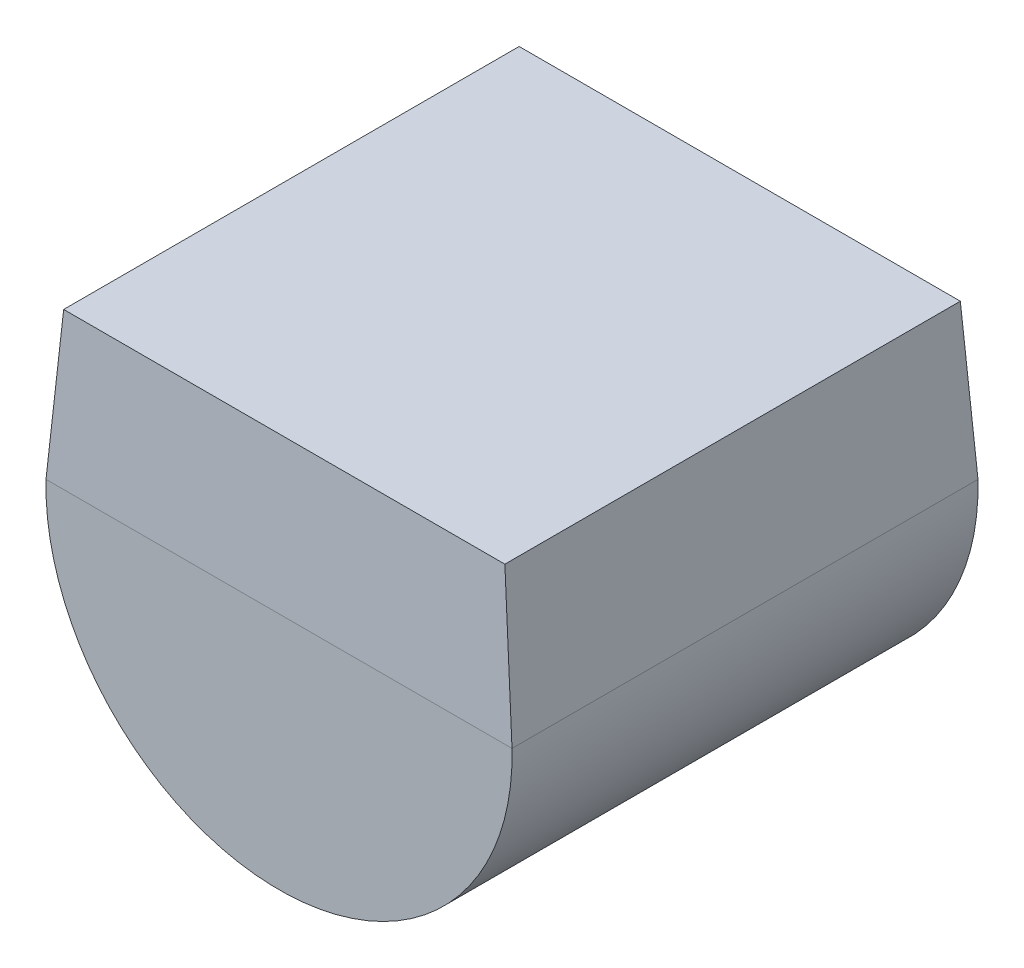
ISO-10303-21;
HEADER;
FILE_DESCRIPTION(('STEP AP214'),'2;1');
FILE_NAME('part.step','',(''),(''),'','','');
FILE_SCHEMA(('AUTOMOTIVE_DESIGN { 1 0 10303 214 1 1 1 1 }'));
ENDSEC;
DATA;
#1=APPLICATION_CONTEXT('core data for automotive mechanical design processes');
#2=APPLICATION_PROTOCOL_DEFINITION('international standard','automotive_design',2000,#1);
#3=PRODUCT_CONTEXT('',#1,'mechanical');
#4=PRODUCT('Part','Part','',(#3));
#5=PRODUCT_RELATED_PRODUCT_CATEGORY('part','',(#4));
#6=PRODUCT_DEFINITION_FORMATION('','',#4);
#7=PRODUCT_DEFINITION_CONTEXT('part definition',#1,'design');
#8=PRODUCT_DEFINITION('design','',#6,#7);
#9=PRODUCT_DEFINITION_SHAPE('','',#8);
#10=(LENGTH_UNIT() NAMED_UNIT(*) SI_UNIT(.MILLI.,.METRE.));
#11=(NAMED_UNIT(*) PLANE_ANGLE_UNIT() SI_UNIT($,.RADIAN.));
#12=(NAMED_UNIT(*) SI_UNIT($,.STERADIAN.) SOLID_ANGLE_UNIT());
#13=UNCERTAINTY_MEASURE_WITH_UNIT(LENGTH_MEASURE(1.E-05),#10,'distance_accuracy_value','');
#14=(GEOMETRIC_REPRESENTATION_CONTEXT(3) GLOBAL_UNCERTAINTY_ASSIGNED_CONTEXT((#13)) GLOBAL_UNIT_ASSIGNED_CONTEXT((#10,
#11,#12)) REPRESENTATION_CONTEXT('',''));
#15=CARTESIAN_POINT('',(0.,0.,0.));
#16=DIRECTION('',(0.,0.,1.));
#17=DIRECTION('',(1.,0.,0.));
#18=AXIS2_PLACEMENT_3D('',#15,#16,#17);
#19=CARTESIAN_POINT('',(0.,0.,1.));
#20=DIRECTION('',(0.,0.,1.));
#21=DIRECTION('',(1.,0.,0.));
#22=AXIS2_PLACEMENT_3D('',#19,#20,#21);
#23=PLANE('',#22);
#24=DIRECTION('',(1.,0.,0.));
#25=VECTOR('',#24,1.);
#26=CARTESIAN_POINT('',(3.875,0.,1.));
#27=LINE('',#26,#25);
#28=CARTESIAN_POINT('',(3.875,0.,1.));
#29=VERTEX_POINT('',#28);
#30=CARTESIAN_POINT('',(3.365,0.,1.));
#31=VERTEX_POINT('',#30);
#32=EDGE_CURVE('E357',#29,#31,#27,.F.);
#33=ORIENTED_EDGE('',*,*,#32,.F.);
#34=DIRECTION('',(0.,1.,0.));
#35=VECTOR('',#34,1.);
#36=CARTESIAN_POINT('',(3.875,-0.48,1.));
#37=LINE('',#36,#35);
#38=CARTESIAN_POINT('',(3.875,-0.48,1.));
#39=VERTEX_POINT('',#38);
#40=EDGE_CURVE('E246',#39,#29,#37,.T.);
#41=ORIENTED_EDGE('',*,*,#40,.F.);
#42=DIRECTION('',(1.,0.,0.));
#43=VECTOR('',#42,1.);
#44=CARTESIAN_POINT('',(3.365,-0.48,1.));
#45=LINE('',#44,#43);
#46=CARTESIAN_POINT('',(3.365,-0.48,1.));
#47=VERTEX_POINT('',#46);
#48=EDGE_CURVE('E245',#47,#39,#45,.T.);
#49=ORIENTED_EDGE('',*,*,#48,.F.);
#50=DIRECTION('',(0.,1.,0.));
#51=VECTOR('',#50,1.);
#52=CARTESIAN_POINT('',(3.365,0.,1.));
#53=LINE('',#52,#51);
#54=EDGE_CURVE('E340',#31,#47,#53,.F.);
#55=ORIENTED_EDGE('',*,*,#54,.F.);
#56=EDGE_LOOP('',(#33,#41,#49,#55));
#57=FACE_BOUND('',#56,.T.);
#58=ADVANCED_FACE('F16',(#57),#23,.F.);
#59=CARTESIAN_POINT('',(3.875,0.,1.));
#60=DIRECTION('',(0.,-1.,0.));
#61=DIRECTION('',(0.,0.,-1.));
#62=AXIS2_PLACEMENT_3D('',#59,#60,#61);
#63=PLANE('',#62);
#64=DIRECTION('',(1.,0.,0.));
#65=VECTOR('',#64,1.);
#66=CARTESIAN_POINT('',(4.575,0.,0.));
#67=LINE('',#66,#65);
#68=CARTESIAN_POINT('',(3.365,0.,0.));
#69=VERTEX_POINT('',#68);
#70=CARTESIAN_POINT('',(3.875,0.,0.));
#71=VERTEX_POINT('',#70);
#72=EDGE_CURVE('E233',#69,#71,#67,.T.);
#73=ORIENTED_EDGE('',*,*,#72,.T.);
#74=DIRECTION('',(0.,0.,1.));
#75=VECTOR('',#74,1.);
#76=CARTESIAN_POINT('',(3.875,0.,1.));
#77=LINE('',#76,#75);
#78=EDGE_CURVE('E242',#29,#71,#77,.F.);
#79=ORIENTED_EDGE('',*,*,#78,.F.);
#80=ORIENTED_EDGE('',*,*,#32,.T.);
#81=DIRECTION('',(0.,0.,-1.));
#82=VECTOR('',#81,1.);
#83=CARTESIAN_POINT('',(3.365,0.,1.));
#84=LINE('',#83,#82);
#85=EDGE_CURVE('E259',#69,#31,#84,.F.);
#86=ORIENTED_EDGE('',*,*,#85,.F.);
#87=EDGE_LOOP('',(#73,#79,#80,#86));
#88=FACE_BOUND('',#87,.T.);
#89=ADVANCED_FACE('F426',(#88),#63,.T.);
#90=CARTESIAN_POINT('',(0.,0.,1.));
#91=DIRECTION('',(0.,0.,1.));
#92=DIRECTION('',(1.,0.,0.));
#93=AXIS2_PLACEMENT_3D('',#90,#91,#92);
#94=PLANE('',#93);
#95=DIRECTION('',(0.,1.,0.));
#96=VECTOR('',#95,1.);
#97=CARTESIAN_POINT('',(2.095,0.,1.));
#98=LINE('',#97,#96);
#99=CARTESIAN_POINT('',(2.095,0.,1.));
#100=VERTEX_POINT('',#99);
#101=CARTESIAN_POINT('',(2.095,-0.48,1.));
#102=VERTEX_POINT('',#101);
#103=EDGE_CURVE('E380',#100,#102,#98,.F.);
#104=ORIENTED_EDGE('',*,*,#103,.F.);
#105=DIRECTION('',(1.,0.,0.));
#106=VECTOR('',#105,1.);
#107=CARTESIAN_POINT('',(2.605,0.,1.));
#108=LINE('',#107,#106);
#109=CARTESIAN_POINT('',(2.605,0.,1.));
#110=VERTEX_POINT('',#109);
#111=EDGE_CURVE('E224',#110,#100,#108,.F.);
#112=ORIENTED_EDGE('',*,*,#111,.F.);
#113=DIRECTION('',(0.,1.,0.));
#114=VECTOR('',#113,1.);
#115=CARTESIAN_POINT('',(2.605,-0.48,1.));
#116=LINE('',#115,#114);
#117=CARTESIAN_POINT('',(2.605,-0.48,1.));
#118=VERTEX_POINT('',#117);
#119=EDGE_CURVE('E262',#118,#110,#116,.T.);
#120=ORIENTED_EDGE('',*,*,#119,.F.);
#121=DIRECTION('',(1.,0.,0.));
#122=VECTOR('',#121,1.);
#123=CARTESIAN_POINT('',(2.095,-0.48,1.));
#124=LINE('',#123,#122);
#125=EDGE_CURVE('E277',#102,#118,#124,.T.);
#126=ORIENTED_EDGE('',*,*,#125,.F.);
#127=EDGE_LOOP('',(#104,#112,#120,#126));
#128=FACE_BOUND('',#127,.T.);
#129=ADVANCED_FACE('F385',(#128),#94,.F.);
#130=CARTESIAN_POINT('',(2.605,0.,1.));
#131=DIRECTION('',(0.,-1.,0.));
#132=DIRECTION('',(0.,0.,-1.));
#133=AXIS2_PLACEMENT_3D('',#130,#131,#132);
#134=PLANE('',#133);
#135=DIRECTION('',(1.,0.,0.));
#136=VECTOR('',#135,1.);
#137=CARTESIAN_POINT('',(4.575,0.,0.));
#138=LINE('',#137,#136);
#139=CARTESIAN_POINT('',(2.095,0.,0.));
#140=VERTEX_POINT('',#139);
#141=CARTESIAN_POINT('',(2.605,0.,0.));
#142=VERTEX_POINT('',#141);
#143=EDGE_CURVE('E267',#140,#142,#138,.T.);
#144=ORIENTED_EDGE('',*,*,#143,.T.);
#145=DIRECTION('',(0.,0.,1.));
#146=VECTOR('',#145,1.);
#147=CARTESIAN_POINT('',(2.605,0.,1.));
#148=LINE('',#147,#146);
#149=EDGE_CURVE('E274',#110,#142,#148,.F.);
#150=ORIENTED_EDGE('',*,*,#149,.F.);
#151=ORIENTED_EDGE('',*,*,#111,.T.);
#152=DIRECTION('',(0.,0.,-1.));
#153=VECTOR('',#152,1.);
#154=CARTESIAN_POINT('',(2.095,0.,1.));
#155=LINE('',#154,#153);
#156=EDGE_CURVE('E289',#140,#100,#155,.F.);
#157=ORIENTED_EDGE('',*,*,#156,.F.);
#158=EDGE_LOOP('',(#144,#150,#151,#157));
#159=FACE_BOUND('',#158,.T.);
#160=ADVANCED_FACE('F322',(#159),#134,.T.);
#161=CARTESIAN_POINT('',(0.,0.,1.));
#162=DIRECTION('',(0.,0.,1.));
#163=DIRECTION('',(1.,0.,0.));
#164=AXIS2_PLACEMENT_3D('',#161,#162,#163);
#165=PLANE('',#164);
#166=DIRECTION('',(1.,0.,0.));
#167=VECTOR('',#166,1.);
#168=CARTESIAN_POINT('',(1.335,0.,1.));
#169=LINE('',#168,#167);
#170=CARTESIAN_POINT('',(1.335,0.,1.));
#171=VERTEX_POINT('',#170);
#172=CARTESIAN_POINT('',(0.824999999999998,0.,1.));
#173=VERTEX_POINT('',#172);
#174=EDGE_CURVE('E221',#171,#173,#169,.F.);
#175=ORIENTED_EDGE('',*,*,#174,.F.);
#176=DIRECTION('',(0.,1.,0.));
#177=VECTOR('',#176,1.);
#178=CARTESIAN_POINT('',(1.335,-0.48,1.));
#179=LINE('',#178,#177);
#180=CARTESIAN_POINT('',(1.335,-0.48,1.));
#181=VERTEX_POINT('',#180);
#182=EDGE_CURVE('E292',#181,#171,#179,.T.);
#183=ORIENTED_EDGE('',*,*,#182,.F.);
#184=DIRECTION('',(1.,0.,0.));
#185=VECTOR('',#184,1.);
#186=CARTESIAN_POINT('',(0.824999999999998,-0.48,1.));
#187=LINE('',#186,#185);
#188=CARTESIAN_POINT('',(0.824999999999998,-0.48,1.));
#189=VERTEX_POINT('',#188);
#190=EDGE_CURVE('E305',#189,#181,#187,.T.);
#191=ORIENTED_EDGE('',*,*,#190,.F.);
#192=DIRECTION('',(0.,1.,0.));
#193=VECTOR('',#192,1.);
#194=CARTESIAN_POINT('',(0.824999999999998,0.,1.));
#195=LINE('',#194,#193);
#196=EDGE_CURVE('E151',#173,#189,#195,.F.);
#197=ORIENTED_EDGE('',*,*,#196,.F.);
#198=EDGE_LOOP('',(#175,#183,#191,#197));
#199=FACE_BOUND('',#198,.T.);
#200=ADVANCED_FACE('F419',(#199),#165,.F.);
#201=CARTESIAN_POINT('',(1.335,0.,1.));
#202=DIRECTION('',(0.,-1.,0.));
#203=DIRECTION('',(0.,0.,-1.));
#204=AXIS2_PLACEMENT_3D('',#201,#202,#203);
#205=PLANE('',#204);
#206=DIRECTION('',(1.,0.,0.));
#207=VECTOR('',#206,1.);
#208=CARTESIAN_POINT('',(4.575,0.,0.));
#209=LINE('',#208,#207);
#210=CARTESIAN_POINT('',(0.824999999999998,0.,0.));
#211=VERTEX_POINT('',#210);
#212=CARTESIAN_POINT('',(1.335,0.,0.));
#213=VERTEX_POINT('',#212);
#214=EDGE_CURVE('E173',#211,#213,#209,.T.);
#215=ORIENTED_EDGE('',*,*,#214,.T.);
#216=DIRECTION('',(0.,0.,1.));
#217=VECTOR('',#216,1.);
#218=CARTESIAN_POINT('',(1.335,0.,1.));
#219=LINE('',#218,#217);
#220=EDGE_CURVE('E302',#171,#213,#219,.F.);
#221=ORIENTED_EDGE('',*,*,#220,.F.);
#222=ORIENTED_EDGE('',*,*,#174,.T.);
#223=DIRECTION('',(0.,0.,-1.));
#224=VECTOR('',#223,1.);
#225=CARTESIAN_POINT('',(0.824999999999998,0.,1.));
#226=LINE('',#225,#224);
#227=EDGE_CURVE('E152',#211,#173,#226,.F.);
#228=ORIENTED_EDGE('',*,*,#227,.F.);
#229=EDGE_LOOP('',(#215,#221,#222,#228));
#230=FACE_BOUND('',#229,.T.);
#231=ADVANCED_FACE('F310',(#230),#205,.T.);
#232=CARTESIAN_POINT('',(4.575,1.52,0.053079569627457));
#233=DIRECTION('',(0.,-0.034899496702501,0.999390827019096));
#234=DIRECTION('',(0.,-0.999390827019096,-0.034899496702501));
#235=AXIS2_PLACEMENT_3D('',#232,#233,#234);
#236=PLANE('',#235);
#237=ORIENTED_EDGE('',*,*,#72,.F.);
#238=DIRECTION('',(1.,0.,0.));
#239=VECTOR('',#238,1.);
#240=CARTESIAN_POINT('',(4.575,0.,0.));
#241=LINE('',#240,#239);
#242=EDGE_CURVE('E250',#142,#69,#241,.T.);
#243=ORIENTED_EDGE('',*,*,#242,.F.);
#244=ORIENTED_EDGE('',*,*,#143,.F.);
#245=DIRECTION('',(1.,0.,0.));
#246=VECTOR('',#245,1.);
#247=CARTESIAN_POINT('',(4.575,0.,0.));
#248=LINE('',#247,#246);
#249=EDGE_CURVE('E281',#213,#140,#248,.T.);
#250=ORIENTED_EDGE('',*,*,#249,.F.);
#251=ORIENTED_EDGE('',*,*,#214,.F.);
#252=DIRECTION('',(1.,0.,0.));
#253=VECTOR('',#252,1.);
#254=CARTESIAN_POINT('',(4.575,0.,0.));
#255=LINE('',#254,#253);
#256=CARTESIAN_POINT('',(0.,0.,0.));
#257=VERTEX_POINT('',#256);
#258=EDGE_CURVE('E157',#257,#211,#255,.T.);
#259=ORIENTED_EDGE('',*,*,#258,.F.);
#260=DIRECTION('',(-0.0819105721426397,-0.99603255725449,-0.0347822233381601));
#261=VECTOR('',#260,1.);
#262=CARTESIAN_POINT('',(0.124999999999998,1.52,0.053079569627457));
#263=LINE('',#262,#261);
#264=CARTESIAN_POINT('',(0.124999999999998,1.52,0.0530795696274554));
#265=VERTEX_POINT('',#264);
#266=EDGE_CURVE('E174',#265,#257,#263,.T.);
#267=ORIENTED_EDGE('',*,*,#266,.F.);
#268=DIRECTION('',(1.,0.,0.));
#269=VECTOR('',#268,1.);
#270=CARTESIAN_POINT('',(4.575,1.52,0.0530795696274556));
#271=LINE('',#270,#269);
#272=CARTESIAN_POINT('',(4.575,1.52,0.0530795696274564));
#273=VERTEX_POINT('',#272);
#274=EDGE_CURVE('E169',#265,#273,#271,.T.);
#275=ORIENTED_EDGE('',*,*,#274,.T.);
#276=DIRECTION('',(-0.0819105721426396,0.99603255725449,0.0347822233381601));
#277=VECTOR('',#276,1.);
#278=CARTESIAN_POINT('',(4.7,0.,0.));
#279=LINE('',#278,#277);
#280=CARTESIAN_POINT('',(4.7,0.,0.));
#281=VERTEX_POINT('',#280);
#282=EDGE_CURVE('E178',#281,#273,#279,.T.);
#283=ORIENTED_EDGE('',*,*,#282,.F.);
#284=DIRECTION('',(1.,0.,0.));
#285=VECTOR('',#284,1.);
#286=CARTESIAN_POINT('',(4.575,0.,0.));
#287=LINE('',#286,#285);
#288=EDGE_CURVE('E219',#71,#281,#287,.T.);
#289=ORIENTED_EDGE('',*,*,#288,.F.);
#290=EDGE_LOOP('',(#237,#243,#244,#250,#251,#259,#267,#275,#283,#289));
#291=FACE_BOUND('',#290,.T.);
#292=ADVANCED_FACE('F218',(#291),#236,.F.);
#293=CARTESIAN_POINT('',(2.35,0.,4.7));
#294=DIRECTION('',(0.,0.034899496702501,0.999390827019096));
#295=DIRECTION('',(0.,-0.999390827019096,0.034899496702501));
#296=AXIS2_PLACEMENT_3D('',#293,#294,#295);
#297=PLANE('',#296);
#298=DIRECTION('',(-0.0819105721426397,0.99603255725449,-0.0347822233381601));
#299=VECTOR('',#298,1.);
#300=CARTESIAN_POINT('',(4.7,0.,4.7));
#301=LINE('',#300,#299);
#302=CARTESIAN_POINT('',(4.7,0.,4.7));
#303=VERTEX_POINT('',#302);
#304=CARTESIAN_POINT('',(4.575,1.52,4.64692043037254));
#305=VERTEX_POINT('',#304);
#306=EDGE_CURVE('E40',#303,#305,#301,.T.);
#307=ORIENTED_EDGE('',*,*,#306,.T.);
#308=DIRECTION('',(1.,0.,0.));
#309=VECTOR('',#308,1.);
#310=CARTESIAN_POINT('',(4.575,1.52,4.64692043037254));
#311=LINE('',#310,#309);
#312=CARTESIAN_POINT('',(0.124999999999998,1.52,4.64692043037254));
#313=VERTEX_POINT('',#312);
#314=EDGE_CURVE('E183',#305,#313,#311,.F.);
#315=ORIENTED_EDGE('',*,*,#314,.T.);
#316=DIRECTION('',(-0.0819105721426391,-0.99603255725449,0.03478222333816));
#317=VECTOR('',#316,1.);
#318=CARTESIAN_POINT('',(0.124999999999998,1.52,4.64692043037254));
#319=LINE('',#318,#317);
#320=CARTESIAN_POINT('',(0.,0.,4.7));
#321=VERTEX_POINT('',#320);
#322=EDGE_CURVE('E32',#313,#321,#319,.T.);
#323=ORIENTED_EDGE('',*,*,#322,.T.);
#324=DIRECTION('',(1.,0.,0.));
#325=VECTOR('',#324,1.);
#326=CARTESIAN_POINT('',(2.35,0.,4.7));
#327=LINE('',#326,#325);
#328=EDGE_CURVE('E361',#303,#321,#327,.F.);
#329=ORIENTED_EDGE('',*,*,#328,.F.);
#330=EDGE_LOOP('',(#307,#315,#323,#329));
#331=FACE_BOUND('',#330,.T.);
#332=ADVANCED_FACE('F411',(#331),#297,.T.);
#333=CARTESIAN_POINT('',(3.875,-0.48,1.));
#334=DIRECTION('',(-1.,0.,0.));
#335=DIRECTION('',(0.,0.,1.));
#336=AXIS2_PLACEMENT_3D('',#333,#334,#335);
#337=PLANE('',#336);
#338=DIRECTION('',(0.,1.,0.));
#339=VECTOR('',#338,1.);
#340=CARTESIAN_POINT('',(3.875,-0.059253112033195,0.));
#341=LINE('',#340,#339);
#342=CARTESIAN_POINT('',(3.875,-0.48,0.));
#343=VERTEX_POINT('',#342);
#344=EDGE_CURVE('E236',#71,#343,#341,.F.);
#345=ORIENTED_EDGE('',*,*,#344,.T.);
#346=DIRECTION('',(0.,0.,1.));
#347=VECTOR('',#346,1.);
#348=CARTESIAN_POINT('',(3.875,-0.48,1.));
#349=LINE('',#348,#347);
#350=EDGE_CURVE('E343',#39,#343,#349,.F.);
#351=ORIENTED_EDGE('',*,*,#350,.F.);
#352=ORIENTED_EDGE('',*,*,#40,.T.);
#353=ORIENTED_EDGE('',*,*,#78,.T.);
#354=EDGE_LOOP('',(#345,#351,#352,#353));
#355=FACE_BOUND('',#354,.T.);
#356=ADVANCED_FACE('F407',(#355),#337,.T.);
#357=CARTESIAN_POINT('',(3.365,-0.48,1.));
#358=DIRECTION('',(0.,1.,0.));
#359=DIRECTION('',(0.,0.,1.));
#360=AXIS2_PLACEMENT_3D('',#357,#358,#359);
#361=PLANE('',#360);
#362=DIRECTION('',(1.,0.,0.));
#363=VECTOR('',#362,1.);
#364=CARTESIAN_POINT('',(2.35,-0.48,0.));
#365=LINE('',#364,#363);
#366=CARTESIAN_POINT('',(3.365,-0.48,0.));
#367=VERTEX_POINT('',#366);
#368=EDGE_CURVE('E238',#343,#367,#365,.F.);
#369=ORIENTED_EDGE('',*,*,#368,.T.);
#370=DIRECTION('',(0.,0.,-1.));
#371=VECTOR('',#370,1.);
#372=CARTESIAN_POINT('',(3.365,-0.48,1.));
#373=LINE('',#372,#371);
#374=EDGE_CURVE('E263',#47,#367,#373,.T.);
#375=ORIENTED_EDGE('',*,*,#374,.F.);
#376=ORIENTED_EDGE('',*,*,#48,.T.);
#377=ORIENTED_EDGE('',*,*,#350,.T.);
#378=EDGE_LOOP('',(#369,#375,#376,#377));
#379=FACE_BOUND('',#378,.T.);
#380=ADVANCED_FACE('F403',(#379),#361,.T.);
#381=CARTESIAN_POINT('',(3.365,0.,1.));
#382=DIRECTION('',(1.,0.,0.));
#383=DIRECTION('',(0.,0.,-1.));
#384=AXIS2_PLACEMENT_3D('',#381,#382,#383);
#385=PLANE('',#384);
#386=DIRECTION('',(0.,1.,0.));
#387=VECTOR('',#386,1.);
#388=CARTESIAN_POINT('',(3.365,-0.059253112033195,0.));
#389=LINE('',#388,#387);
#390=EDGE_CURVE('E253',#367,#69,#389,.T.);
#391=ORIENTED_EDGE('',*,*,#390,.T.);
#392=ORIENTED_EDGE('',*,*,#85,.T.);
#393=ORIENTED_EDGE('',*,*,#54,.T.);
#394=ORIENTED_EDGE('',*,*,#374,.T.);
#395=EDGE_LOOP('',(#391,#392,#393,#394));
#396=FACE_BOUND('',#395,.T.);
#397=ADVANCED_FACE('F400',(#396),#385,.T.);
#398=CARTESIAN_POINT('',(2.605,-0.48,1.));
#399=DIRECTION('',(-1.,0.,0.));
#400=DIRECTION('',(0.,0.,1.));
#401=AXIS2_PLACEMENT_3D('',#398,#399,#400);
#402=PLANE('',#401);
#403=DIRECTION('',(0.,1.,0.));
#404=VECTOR('',#403,1.);
#405=CARTESIAN_POINT('',(2.605,-0.059253112033195,0.));
#406=LINE('',#405,#404);
#407=CARTESIAN_POINT('',(2.605,-0.48,0.));
#408=VERTEX_POINT('',#407);
#409=EDGE_CURVE('E256',#142,#408,#406,.F.);
#410=ORIENTED_EDGE('',*,*,#409,.T.);
#411=DIRECTION('',(0.,0.,1.));
#412=VECTOR('',#411,1.);
#413=CARTESIAN_POINT('',(2.605,-0.48,1.));
#414=LINE('',#413,#412);
#415=EDGE_CURVE('E331',#118,#408,#414,.F.);
#416=ORIENTED_EDGE('',*,*,#415,.F.);
#417=ORIENTED_EDGE('',*,*,#119,.T.);
#418=ORIENTED_EDGE('',*,*,#149,.T.);
#419=EDGE_LOOP('',(#410,#416,#417,#418));
#420=FACE_BOUND('',#419,.T.);
#421=ADVANCED_FACE('F330',(#420),#402,.T.);
#422=CARTESIAN_POINT('',(2.095,-0.48,1.));
#423=DIRECTION('',(0.,1.,0.));
#424=DIRECTION('',(0.,0.,1.));
#425=AXIS2_PLACEMENT_3D('',#422,#423,#424);
#426=PLANE('',#425);
#427=DIRECTION('',(1.,0.,0.));
#428=VECTOR('',#427,1.);
#429=CARTESIAN_POINT('',(2.35,-0.48,0.));
#430=LINE('',#429,#428);
#431=CARTESIAN_POINT('',(2.095,-0.48,0.));
#432=VERTEX_POINT('',#431);
#433=EDGE_CURVE('E271',#408,#432,#430,.F.);
#434=ORIENTED_EDGE('',*,*,#433,.T.);
#435=DIRECTION('',(0.,0.,-1.));
#436=VECTOR('',#435,1.);
#437=CARTESIAN_POINT('',(2.095,-0.48,1.));
#438=LINE('',#437,#436);
#439=EDGE_CURVE('E293',#102,#432,#438,.T.);
#440=ORIENTED_EDGE('',*,*,#439,.F.);
#441=ORIENTED_EDGE('',*,*,#125,.T.);
#442=ORIENTED_EDGE('',*,*,#415,.T.);
#443=EDGE_LOOP('',(#434,#440,#441,#442));
#444=FACE_BOUND('',#443,.T.);
#445=ADVANCED_FACE('F384',(#444),#426,.T.);
#446=CARTESIAN_POINT('',(2.095,0.,1.));
#447=DIRECTION('',(1.,0.,0.));
#448=DIRECTION('',(0.,0.,-1.));
#449=AXIS2_PLACEMENT_3D('',#446,#447,#448);
#450=PLANE('',#449);
#451=DIRECTION('',(0.,1.,0.));
#452=VECTOR('',#451,1.);
#453=CARTESIAN_POINT('',(2.095,-0.059253112033195,0.));
#454=LINE('',#453,#452);
#455=EDGE_CURVE('E284',#432,#140,#454,.T.);
#456=ORIENTED_EDGE('',*,*,#455,.T.);
#457=ORIENTED_EDGE('',*,*,#156,.T.);
#458=ORIENTED_EDGE('',*,*,#103,.T.);
#459=ORIENTED_EDGE('',*,*,#439,.T.);
#460=EDGE_LOOP('',(#456,#457,#458,#459));
#461=FACE_BOUND('',#460,.T.);
#462=ADVANCED_FACE('F387',(#461),#450,.T.);
#463=CARTESIAN_POINT('',(1.335,-0.48,1.));
#464=DIRECTION('',(-1.,0.,0.));
#465=DIRECTION('',(0.,0.,1.));
#466=AXIS2_PLACEMENT_3D('',#463,#464,#465);
#467=PLANE('',#466);
#468=DIRECTION('',(0.,1.,0.));
#469=VECTOR('',#468,1.);
#470=CARTESIAN_POINT('',(1.335,-0.059253112033195,0.));
#471=LINE('',#470,#469);
#472=CARTESIAN_POINT('',(1.335,-0.48,0.));
#473=VERTEX_POINT('',#472);
#474=EDGE_CURVE('E144',#213,#473,#471,.F.);
#475=ORIENTED_EDGE('',*,*,#474,.T.);
#476=DIRECTION('',(0.,0.,1.));
#477=VECTOR('',#476,1.);
#478=CARTESIAN_POINT('',(1.335,-0.48,1.));
#479=LINE('',#478,#477);
#480=EDGE_CURVE('E139',#181,#473,#479,.F.);
#481=ORIENTED_EDGE('',*,*,#480,.F.);
#482=ORIENTED_EDGE('',*,*,#182,.T.);
#483=ORIENTED_EDGE('',*,*,#220,.T.);
#484=EDGE_LOOP('',(#475,#481,#482,#483));
#485=FACE_BOUND('',#484,.T.);
#486=ADVANCED_FACE('F315',(#485),#467,.T.);
#487=CARTESIAN_POINT('',(0.824999999999998,-0.48,1.));
#488=DIRECTION('',(0.,1.,0.));
#489=DIRECTION('',(0.,0.,1.));
#490=AXIS2_PLACEMENT_3D('',#487,#488,#489);
#491=PLANE('',#490);
#492=DIRECTION('',(1.,0.,0.));
#493=VECTOR('',#492,1.);
#494=CARTESIAN_POINT('',(2.35,-0.48,0.));
#495=LINE('',#494,#493);
#496=CARTESIAN_POINT('',(0.824999999999998,-0.48,0.));
#497=VERTEX_POINT('',#496);
#498=EDGE_CURVE('E132',#473,#497,#495,.F.);
#499=ORIENTED_EDGE('',*,*,#498,.T.);
#500=DIRECTION('',(0.,0.,-1.));
#501=VECTOR('',#500,1.);
#502=CARTESIAN_POINT('',(0.824999999999998,-0.48,1.));
#503=LINE('',#502,#501);
#504=EDGE_CURVE('E136',#189,#497,#503,.T.);
#505=ORIENTED_EDGE('',*,*,#504,.F.);
#506=ORIENTED_EDGE('',*,*,#190,.T.);
#507=ORIENTED_EDGE('',*,*,#480,.T.);
#508=EDGE_LOOP('',(#499,#505,#506,#507));
#509=FACE_BOUND('',#508,.T.);
#510=ADVANCED_FACE('F134',(#509),#491,.T.);
#511=CARTESIAN_POINT('',(0.824999999999998,0.,1.));
#512=DIRECTION('',(1.,0.,0.));
#513=DIRECTION('',(0.,0.,-1.));
#514=AXIS2_PLACEMENT_3D('',#511,#512,#513);
#515=PLANE('',#514);
#516=DIRECTION('',(0.,1.,0.));
#517=VECTOR('',#516,1.);
#518=CARTESIAN_POINT('',(0.824999999999998,-0.059253112033195,0.));
#519=LINE('',#518,#517);
#520=EDGE_CURVE('E143',#497,#211,#519,.T.);
#521=ORIENTED_EDGE('',*,*,#520,.T.);
#522=ORIENTED_EDGE('',*,*,#227,.T.);
#523=ORIENTED_EDGE('',*,*,#196,.T.);
#524=ORIENTED_EDGE('',*,*,#504,.T.);
#525=EDGE_LOOP('',(#521,#522,#523,#524));
#526=FACE_BOUND('',#525,.T.);
#527=ADVANCED_FACE('F148',(#526),#515,.T.);
#528=CARTESIAN_POINT('',(4.575,1.52,4.7));
#529=DIRECTION('',(0.,-1.,0.));
#530=DIRECTION('',(0.,0.,-1.));
#531=AXIS2_PLACEMENT_3D('',#528,#529,#530);
#532=PLANE('',#531);
#533=DIRECTION('',(0.,0.,1.));
#534=VECTOR('',#533,1.);
#535=CARTESIAN_POINT('',(4.575,1.52,4.7));
#536=LINE('',#535,#534);
#537=EDGE_CURVE('E158',#305,#273,#536,.F.);
#538=ORIENTED_EDGE('',*,*,#537,.T.);
#539=ORIENTED_EDGE('',*,*,#274,.F.);
#540=DIRECTION('',(0.,0.,1.));
#541=VECTOR('',#540,1.);
#542=CARTESIAN_POINT('',(0.124999999999998,1.52,4.7));
#543=LINE('',#542,#541);
#544=EDGE_CURVE('E239',#265,#313,#543,.T.);
#545=ORIENTED_EDGE('',*,*,#544,.T.);
#546=ORIENTED_EDGE('',*,*,#314,.F.);
#547=EDGE_LOOP('',(#538,#539,#545,#546));
#548=FACE_BOUND('',#547,.T.);
#549=ADVANCED_FACE('F449',(#548),#532,.F.);
#550=CARTESIAN_POINT('',(2.35,-2.156,2.35));
#551=DIRECTION('',(0.,-1.,0.));
#552=DIRECTION('',(0.,0.,-1.));
#553=AXIS2_PLACEMENT_3D('',#550,#551,#552);
#554=PLANE('',#553);
#555=CARTESIAN_POINT('',(2.35,-2.156,2.35));
#556=DIRECTION('',(0.,1.,0.));
#557=DIRECTION('',(0.,0.,1.));
#558=AXIS2_PLACEMENT_3D('',#555,#556,#557);
#559=CIRCLE('',#558,0.76);
#560=CARTESIAN_POINT('',(2.35,-2.156,3.11));
#561=VERTEX_POINT('',#560);
#562=EDGE_CURVE('E19',#561,#561,#559,.F.);
#563=ORIENTED_EDGE('',*,*,#562,.T.);
#564=EDGE_LOOP('',(#563));
#565=FACE_BOUND('',#564,.T.);
#566=ADVANCED_FACE('F445',(#565),#554,.T.);
#567=CARTESIAN_POINT('',(2.35,-0.059253112033195,4.7));
#568=DIRECTION('',(0.,0.,1.));
#569=DIRECTION('',(1.,0.,0.));
#570=AXIS2_PLACEMENT_3D('',#567,#568,#569);
#571=PLANE('',#570);
#572=CARTESIAN_POINT('',(2.35,-0.059253112033195,4.7));
#573=DIRECTION('',(0.,0.,-1.));
#574=DIRECTION('',(-1.,0.,0.));
#575=AXIS2_PLACEMENT_3D('',#572,#573,#574);
#576=CIRCLE('',#575,2.35074688796681);
#577=EDGE_CURVE('E441',#303,#321,#576,.T.);
#578=ORIENTED_EDGE('',*,*,#577,.F.);
#579=ORIENTED_EDGE('',*,*,#328,.T.);
#580=EDGE_LOOP('',(#578,#579));
#581=FACE_BOUND('',#580,.T.);
#582=ADVANCED_FACE('F448',(#581),#571,.T.);
#583=CARTESIAN_POINT('',(0.124999999999998,1.52,4.7));
#584=DIRECTION('',(0.996635606105433,-0.081960164975774,0.));
#585=DIRECTION('',(0.081960164975774,0.996635606105433,0.));
#586=AXIS2_PLACEMENT_3D('',#583,#584,#585);
#587=PLANE('',#586);
#588=ORIENTED_EDGE('',*,*,#544,.F.);
#589=ORIENTED_EDGE('',*,*,#266,.T.);
#590=DIRECTION('',(0.,0.,-1.));
#591=VECTOR('',#590,1.);
#592=CARTESIAN_POINT('',(0.,0.,4.7));
#593=LINE('',#592,#591);
#594=EDGE_CURVE('E212',#321,#257,#593,.T.);
#595=ORIENTED_EDGE('',*,*,#594,.F.);
#596=ORIENTED_EDGE('',*,*,#322,.F.);
#597=EDGE_LOOP('',(#588,#589,#595,#596));
#598=FACE_BOUND('',#597,.T.);
#599=ADVANCED_FACE('F455',(#598),#587,.F.);
#600=CARTESIAN_POINT('',(2.35,-0.059253112033195,0.));
#601=DIRECTION('',(0.,0.,1.));
#602=DIRECTION('',(1.,0.,0.));
#603=AXIS2_PLACEMENT_3D('',#600,#601,#602);
#604=PLANE('',#603);
#605=ORIENTED_EDGE('',*,*,#498,.F.);
#606=ORIENTED_EDGE('',*,*,#474,.F.);
#607=ORIENTED_EDGE('',*,*,#249,.T.);
#608=ORIENTED_EDGE('',*,*,#455,.F.);
#609=ORIENTED_EDGE('',*,*,#433,.F.);
#610=ORIENTED_EDGE('',*,*,#409,.F.);
#611=ORIENTED_EDGE('',*,*,#242,.T.);
#612=ORIENTED_EDGE('',*,*,#390,.F.);
#613=ORIENTED_EDGE('',*,*,#368,.F.);
#614=ORIENTED_EDGE('',*,*,#344,.F.);
#615=ORIENTED_EDGE('',*,*,#288,.T.);
#616=CARTESIAN_POINT('',(2.35,-0.059253112033195,0.));
#617=DIRECTION('',(0.,0.,-1.));
#618=DIRECTION('',(-1.,0.,0.));
#619=AXIS2_PLACEMENT_3D('',#616,#617,#618);
#620=CIRCLE('',#619,2.35074688796681);
#621=EDGE_CURVE('E191',#257,#281,#620,.F.);
#622=ORIENTED_EDGE('',*,*,#621,.F.);
#623=ORIENTED_EDGE('',*,*,#258,.T.);
#624=ORIENTED_EDGE('',*,*,#520,.F.);
#625=EDGE_LOOP('',(#605,#606,#607,#608,#609,#610,#611,#612,#613,#614,#615,#622,#623,#624));
#626=FACE_BOUND('',#625,.T.);
#627=ADVANCED_FACE('F154',(#626),#604,.F.);
#628=CARTESIAN_POINT('',(4.7,0.,4.7));
#629=DIRECTION('',(-0.996635606105433,-0.081960164975776,0.));
#630=DIRECTION('',(0.081960164975776,-0.996635606105433,0.));
#631=AXIS2_PLACEMENT_3D('',#628,#629,#630);
#632=PLANE('',#631);
#633=DIRECTION('',(0.,0.,-1.));
#634=VECTOR('',#633,1.);
#635=CARTESIAN_POINT('',(4.7,0.,4.7));
#636=LINE('',#635,#634);
#637=EDGE_CURVE('E24',#281,#303,#636,.F.);
#638=ORIENTED_EDGE('',*,*,#637,.F.);
#639=ORIENTED_EDGE('',*,*,#282,.T.);
#640=ORIENTED_EDGE('',*,*,#537,.F.);
#641=ORIENTED_EDGE('',*,*,#306,.F.);
#642=EDGE_LOOP('',(#638,#639,#640,#641));
#643=FACE_BOUND('',#642,.T.);
#644=ADVANCED_FACE('F203',(#643),#632,.F.);
#645=CARTESIAN_POINT('',(2.35,-2.651,2.35));
#646=DIRECTION('',(0.,1.,0.));
#647=DIRECTION('',(0.,0.,1.));
#648=AXIS2_PLACEMENT_3D('',#645,#646,#647);
#649=CYLINDRICAL_SURFACE('',#648,0.76);
#650=ORIENTED_EDGE('',*,*,#562,.F.);
#651=EDGE_LOOP('',(#650));
#652=FACE_BOUND('',#651,.T.);
#653=CARTESIAN_POINT('',(2.35,-2.41,3.11));
#654=CARTESIAN_POINT('',(2.39148133753724,-2.40999838809873,3.10999769045107));
#655=CARTESIAN_POINT('',(2.43300621889808,-2.40889007675102,3.10658813377346));
#656=CARTESIAN_POINT('',(2.51487956935435,-2.4045705009379,3.09306270929551));
#657=CARTESIAN_POINT('',(2.55522592370103,-2.40135567287555,3.08293547683621));
#658=CARTESIAN_POINT('',(2.63348591555128,-2.3931749812153,3.05635627570562));
#659=CARTESIAN_POINT('',(2.67140473907231,-2.38821300840799,3.03991835328952));
#660=CARTESIAN_POINT('',(2.74393386542263,-2.37704847126585,3.00123438992833));
#661=CARTESIAN_POINT('',(2.77854462731808,-2.37084607943688,2.97898915647846));
#662=CARTESIAN_POINT('',(2.84463126548733,-2.35762663310936,2.92854872816042));
#663=CARTESIAN_POINT('',(2.87598345981472,-2.35059085024039,2.90019640068964));
#664=CARTESIAN_POINT('',(2.93358246402095,-2.33660306143866,2.83867965590574));
#665=CARTESIAN_POINT('',(2.95982796452392,-2.32965107741974,2.80551400823464));
#666=CARTESIAN_POINT('',(3.00715176695391,-2.31641592451837,2.73422618589794));
#667=CARTESIAN_POINT('',(3.02807316864717,-2.31015560476728,2.69599520593587));
#668=CARTESIAN_POINT('',(3.06313746871979,-2.29929447206009,2.61632249205222));
#669=CARTESIAN_POINT('',(3.07728233105418,-2.2946931783861,2.57488169243993));
#670=CARTESIAN_POINT('',(3.09793574910983,-2.28786674026491,2.49136082379313));
#671=CARTESIAN_POINT('',(3.10467395264543,-2.28557034179247,2.44934353451218));
#672=CARTESIAN_POINT('',(3.1110404749731,-2.28340254509432,2.36471686418234));
#673=CARTESIAN_POINT('',(3.11067083647504,-2.28353045015227,2.32210765676126));
#674=CARTESIAN_POINT('',(3.10301113364614,-2.28613414019609,2.23943631906489));
#675=CARTESIAN_POINT('',(3.09601695461878,-2.28850953618194,2.19934307193824));
#676=CARTESIAN_POINT('',(3.07578788933267,-2.29517688914303,2.12093268410818));
#677=CARTESIAN_POINT('',(3.06255226653713,-2.29946907231025,2.08261575360962));
#678=CARTESIAN_POINT('',(3.03001456582108,-2.30956065798863,2.00815685153405));
#679=CARTESIAN_POINT('',(3.01062212589809,-2.31538227258798,1.9720575075583));
#680=CARTESIAN_POINT('',(2.96638510792958,-2.32786662372177,1.90353208182679));
#681=CARTESIAN_POINT('',(2.9415393319892,-2.33452954492314,1.87110680950429));
#682=CARTESIAN_POINT('',(2.88566904633153,-2.34834374596966,1.80918480945184));
#683=CARTESIAN_POINT('',(2.85440230212113,-2.35550299549516,1.7799080204628));
#684=CARTESIAN_POINT('',(2.78730141183522,-2.36922053120694,1.72694734663152));
#685=CARTESIAN_POINT('',(2.7514652902157,-2.37577855533619,1.70326589361051));
#686=CARTESIAN_POINT('',(2.67578682338106,-2.38763328784766,1.66200396901097));
#687=CARTESIAN_POINT('',(2.63590949097383,-2.39291735418395,1.64448391392025));
#688=CARTESIAN_POINT('',(2.55360616665264,-2.40152922281107,1.61649751577206));
#689=CARTESIAN_POINT('',(2.51118560050503,-2.40486103707754,1.60601670019297));
#690=CARTESIAN_POINT('',(2.44864750014284,-2.40801142572628,1.59616899130953));
#691=CARTESIAN_POINT('',(2.42899981621626,-2.40875495643644,1.59385840983997));
#692=CARTESIAN_POINT('',(2.38957139224566,-2.40974962865958,1.59077336146965));
#693=CARTESIAN_POINT('',(2.36979065189421,-2.41000076903445,1.58999889811941));
#694=CARTESIAN_POINT('',(2.30851866246277,-2.40999838809875,1.59000230954885));
#695=CARTESIAN_POINT('',(2.26699378110193,-2.40889007675103,1.59341186622652));
#696=CARTESIAN_POINT('',(2.18512043064566,-2.4045705009379,1.6069372907045));
#697=CARTESIAN_POINT('',(2.14477407629898,-2.40135567287555,1.6170645231638));
#698=CARTESIAN_POINT('',(2.06651408444872,-2.3931749812153,1.64364372429437));
#699=CARTESIAN_POINT('',(2.02859526092769,-2.38821300840799,1.66008164671048));
#700=CARTESIAN_POINT('',(1.95606613457736,-2.37704847126585,1.69876561007167));
#701=CARTESIAN_POINT('',(1.92145537268192,-2.37084607943688,1.72101084352154));
#702=CARTESIAN_POINT('',(1.85536873451267,-2.35762663310936,1.77145127183958));
#703=CARTESIAN_POINT('',(1.82401654018528,-2.35059085024039,1.79980359931035));
#704=CARTESIAN_POINT('',(1.76641753597905,-2.33660306143866,1.86132034409426));
#705=CARTESIAN_POINT('',(1.74017203547608,-2.32965107741974,1.89448599176536));
#706=CARTESIAN_POINT('',(1.69284823304609,-2.31641592451837,1.96577381410206));
#707=CARTESIAN_POINT('',(1.67192683135283,-2.31015560476728,2.00400479406413));
#708=CARTESIAN_POINT('',(1.63686253128021,-2.29929447206009,2.08367750794778));
#709=CARTESIAN_POINT('',(1.62271766894582,-2.2946931783861,2.12511830756007));
#710=CARTESIAN_POINT('',(1.60206425089017,-2.28786674026491,2.20863917620688));
#711=CARTESIAN_POINT('',(1.59532604735457,-2.28557034179247,2.25065646548782));
#712=CARTESIAN_POINT('',(1.5889595250269,-2.28340254509432,2.33528313581766));
#713=CARTESIAN_POINT('',(1.58932916352496,-2.28353045015227,2.37789234323874));
#714=CARTESIAN_POINT('',(1.59698886635386,-2.28613414019609,2.46056368093511));
#715=CARTESIAN_POINT('',(1.60398304538122,-2.28850953618194,2.50065692806176));
#716=CARTESIAN_POINT('',(1.62421211066733,-2.29517688914303,2.57906731589182));
#717=CARTESIAN_POINT('',(1.63744773346287,-2.29946907231025,2.61738424639038));
#718=CARTESIAN_POINT('',(1.66998543417892,-2.30956065798863,2.69184314846595));
#719=CARTESIAN_POINT('',(1.68937787410191,-2.31538227258798,2.7279424924417));
#720=CARTESIAN_POINT('',(1.73361489207042,-2.32786662372177,2.79646791817321));
#721=CARTESIAN_POINT('',(1.7584606680108,-2.33452954492314,2.82889319049571));
#722=CARTESIAN_POINT('',(1.81433095366847,-2.34834374596966,2.89081519054816));
#723=CARTESIAN_POINT('',(1.84559769787887,-2.35550299549516,2.9200919795372));
#724=CARTESIAN_POINT('',(1.91269858816478,-2.36922053120694,2.97305265336848));
#725=CARTESIAN_POINT('',(1.9485347097843,-2.37577855533619,2.99673410638949));
#726=CARTESIAN_POINT('',(2.02421317661894,-2.38763328784766,3.03799603098903));
#727=CARTESIAN_POINT('',(2.06409050902617,-2.39291735418395,3.05551608607975));
#728=CARTESIAN_POINT('',(2.14639383334737,-2.40152922281107,3.08350248422794));
#729=CARTESIAN_POINT('',(2.18881439949497,-2.40486103707754,3.09398329980703));
#730=CARTESIAN_POINT('',(2.25135249985716,-2.40801142572628,3.10383100869048));
#731=CARTESIAN_POINT('',(2.27100018378375,-2.40875495643645,3.10614159016004));
#732=CARTESIAN_POINT('',(2.31042860775434,-2.40974962865957,3.10922663853034));
#733=CARTESIAN_POINT('',(2.33020934810579,-2.41000076903444,3.11000110188055));
#734=CARTESIAN_POINT('',(2.35,-2.41,3.11));
#735=B_SPLINE_CURVE_WITH_KNOTS('',3,(#653,#654,#655,#656,#657,#658,#659,#660,#661,#662,#663,
#664,#665,#666,#667,#668,#669,#670,#671,#672,#673,#674,#675,#676,#677,#678,#679,#680,#681,#682,
#683,#684,#685,#686,#687,#688,#689,#690,#691,#692,#693,#694,#695,#696,#697,#698,#699,#700,#701,
#702,#703,#704,#705,#706,#707,#708,#709,#710,#711,#712,#713,#714,#715,#716,#717,#718,#719,#720,
#721,#722,#723,#724,#725,#726,#727,#728,#729,#730,#731,#732,#733,#734),.UNSPECIFIED.,.T.,.F.,(4,
2,2,2,2,2,2,2,2,2,2,2,2,2,2,2,2,2,2,2,2,2,2,2,2,2,2,2,2,2,2,2,2,2,2,2,2,2,2,2,4),(0.,
0.124367714512486,0.248946367120448,0.373249326834846,0.497535011664115,0.625513083547907,
0.753523926383035,0.884957060001868,1.01635207901132,1.14354694019784,1.27070524762981,
1.3924392150346,1.51418755154915,1.63781248106119,1.76146459359305,1.89114701041417,
2.02088568600754,2.15186321365638,2.28257062324495,2.34190604013259,2.40124159416541,
2.5256093086779,2.65018796128587,2.77449092100027,2.89877660582954,3.02675467771333,
3.15476552054846,3.28619865416729,3.41759367317675,3.54478853436326,3.67194684179524,
3.79368080920003,3.91542914571458,4.03905407522662,4.16270618775847,4.2923886045796,
4.42212728017296,4.55310480782181,4.68381221741038,4.74314763429801,4.80248318833084),.UNSPECIFIED.);
#736=CARTESIAN_POINT('',(2.35,-2.41,3.11));
#737=VERTEX_POINT('',#736);
#738=EDGE_CURVE('E10',#737,#737,#735,.T.);
#739=ORIENTED_EDGE('',*,*,#738,.F.);
#740=EDGE_LOOP('',(#739));
#741=FACE_BOUND('',#740,.T.);
#742=ADVANCED_FACE('F192',(#652,#741),#649,.F.);
#743=CARTESIAN_POINT('',(2.35,-0.059253112033195,4.7));
#744=DIRECTION('',(0.,0.,-1.));
#745=DIRECTION('',(-1.,0.,0.));
#746=AXIS2_PLACEMENT_3D('',#743,#744,#745);
#747=CYLINDRICAL_SURFACE('',#746,2.35074688796681);
#748=ORIENTED_EDGE('',*,*,#738,.T.);
#749=EDGE_LOOP('',(#748));
#750=FACE_BOUND('',#749,.T.);
#751=ORIENTED_EDGE('',*,*,#621,.T.);
#752=ORIENTED_EDGE('',*,*,#637,.T.);
#753=ORIENTED_EDGE('',*,*,#577,.T.);
#754=ORIENTED_EDGE('',*,*,#594,.T.);
#755=EDGE_LOOP('',(#751,#752,#753,#754));
#756=FACE_BOUND('',#755,.T.);
#757=ADVANCED_FACE('F195',(#750,#756),#747,.T.);
#758=CLOSED_SHELL('',(#58,#89,#129,#160,#200,#231,#292,#332,#356,#380,#397,#421,#445,#462,#486,
#510,#527,#549,#566,#582,#599,#627,#644,#742,#757));
#759=MANIFOLD_SOLID_BREP('B1',#758);
#760=ADVANCED_BREP_SHAPE_REPRESENTATION('',(#18,#759),#14);
#761=SHAPE_DEFINITION_REPRESENTATION(#9,#760);
ENDSEC;
END-ISO-10303-21;
